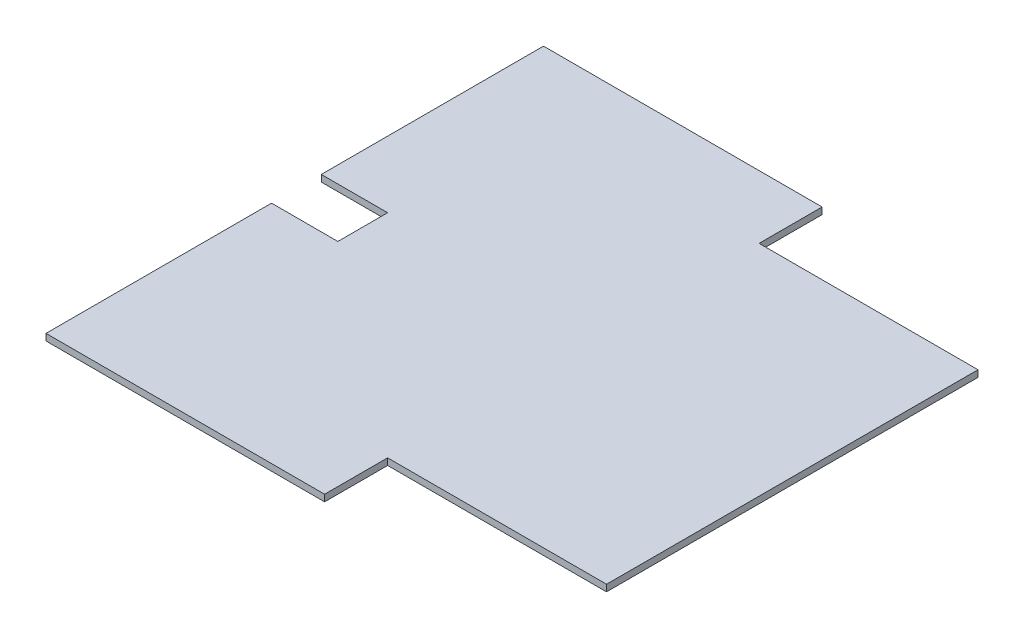
ISO-10303-21;
HEADER;
FILE_DESCRIPTION(('STEP AP214'),'2;1');
FILE_NAME('part.step','',(''),(''),'','','');
FILE_SCHEMA(('AUTOMOTIVE_DESIGN { 1 0 10303 214 1 1 1 1 }'));
ENDSEC;
DATA;
#1=APPLICATION_CONTEXT('core data for automotive mechanical design processes');
#2=APPLICATION_PROTOCOL_DEFINITION('international standard','automotive_design',2000,#1);
#3=PRODUCT_CONTEXT('',#1,'mechanical');
#4=PRODUCT('Part','Part','',(#3));
#5=PRODUCT_RELATED_PRODUCT_CATEGORY('part','',(#4));
#6=PRODUCT_DEFINITION_FORMATION('','',#4);
#7=PRODUCT_DEFINITION_CONTEXT('part definition',#1,'design');
#8=PRODUCT_DEFINITION('design','',#6,#7);
#9=PRODUCT_DEFINITION_SHAPE('','',#8);
#10=(LENGTH_UNIT() NAMED_UNIT(*) SI_UNIT(.MILLI.,.METRE.));
#11=(NAMED_UNIT(*) PLANE_ANGLE_UNIT() SI_UNIT($,.RADIAN.));
#12=(NAMED_UNIT(*) SI_UNIT($,.STERADIAN.) SOLID_ANGLE_UNIT());
#13=UNCERTAINTY_MEASURE_WITH_UNIT(LENGTH_MEASURE(1.E-05),#10,'distance_accuracy_value','');
#14=(GEOMETRIC_REPRESENTATION_CONTEXT(3) GLOBAL_UNCERTAINTY_ASSIGNED_CONTEXT((#13)) GLOBAL_UNIT_ASSIGNED_CONTEXT((#10,
#11,#12)) REPRESENTATION_CONTEXT('',''));
#15=CARTESIAN_POINT('',(0.,0.,0.));
#16=DIRECTION('',(0.,0.,1.));
#17=DIRECTION('',(1.,0.,0.));
#18=AXIS2_PLACEMENT_3D('',#15,#16,#17);
#19=CARTESIAN_POINT('',(-75.,2.,-75.));
#20=DIRECTION('',(1.,0.,0.));
#21=DIRECTION('',(0.,0.,-1.));
#22=AXIS2_PLACEMENT_3D('',#19,#20,#21);
#23=PLANE('',#22);
#24=DIRECTION('',(0.,0.,1.));
#25=VECTOR('',#24,1.);
#26=CARTESIAN_POINT('',(-75.,0.,-75.));
#27=LINE('',#26,#25);
#28=CARTESIAN_POINT('',(-75.,0.,-75.));
#29=VERTEX_POINT('',#28);
#30=CARTESIAN_POINT('',(-75.,0.,-7.99999999999999));
#31=VERTEX_POINT('',#30);
#32=EDGE_CURVE('E155',#29,#31,#27,.T.);
#33=ORIENTED_EDGE('',*,*,#32,.T.);
#34=DIRECTION('',(0.,1.,0.));
#35=VECTOR('',#34,1.);
#36=CARTESIAN_POINT('',(-75.,-0.00100000000000013,-7.99999999999999));
#37=LINE('',#36,#35);
#38=CARTESIAN_POINT('',(-75.,2.,-7.99999999999999));
#39=VERTEX_POINT('',#38);
#40=EDGE_CURVE('E218',#31,#39,#37,.T.);
#41=ORIENTED_EDGE('',*,*,#40,.T.);
#42=DIRECTION('',(0.,0.,1.));
#43=VECTOR('',#42,1.);
#44=CARTESIAN_POINT('',(-75.,2.,-75.));
#45=LINE('',#44,#43);
#46=CARTESIAN_POINT('',(-75.,2.,-75.));
#47=VERTEX_POINT('',#46);
#48=EDGE_CURVE('E161',#47,#39,#45,.T.);
#49=ORIENTED_EDGE('',*,*,#48,.F.);
#50=DIRECTION('',(0.,-1.,0.));
#51=VECTOR('',#50,1.);
#52=CARTESIAN_POINT('',(-75.,2.,-75.));
#53=LINE('',#52,#51);
#54=EDGE_CURVE('E11',#47,#29,#53,.T.);
#55=ORIENTED_EDGE('',*,*,#54,.T.);
#56=EDGE_LOOP('',(#33,#41,#49,#55));
#57=FACE_BOUND('',#56,.T.);
#58=ADVANCED_FACE('F35',(#57),#23,.F.);
#59=CARTESIAN_POINT('',(75.,2.,-75.));
#60=DIRECTION('',(-1.,0.,0.));
#61=DIRECTION('',(0.,0.,1.));
#62=AXIS2_PLACEMENT_3D('',#59,#60,#61);
#63=PLANE('',#62);
#64=DIRECTION('',(0.,0.,-1.));
#65=VECTOR('',#64,1.);
#66=CARTESIAN_POINT('',(75.,2.,-75.));
#67=LINE('',#66,#65);
#68=CARTESIAN_POINT('',(75.,2.,56.));
#69=VERTEX_POINT('',#68);
#70=CARTESIAN_POINT('',(75.,2.,-56.));
#71=VERTEX_POINT('',#70);
#72=EDGE_CURVE('E144',#69,#71,#67,.T.);
#73=ORIENTED_EDGE('',*,*,#72,.F.);
#74=DIRECTION('',(0.,-1.,0.));
#75=VECTOR('',#74,1.);
#76=CARTESIAN_POINT('',(75.,2.001,56.));
#77=LINE('',#76,#75);
#78=CARTESIAN_POINT('',(75.,0.,56.));
#79=VERTEX_POINT('',#78);
#80=EDGE_CURVE('E125',#69,#79,#77,.T.);
#81=ORIENTED_EDGE('',*,*,#80,.T.);
#82=DIRECTION('',(0.,0.,-1.));
#83=VECTOR('',#82,1.);
#84=CARTESIAN_POINT('',(75.,0.,-75.));
#85=LINE('',#84,#83);
#86=CARTESIAN_POINT('',(75.,0.,-56.));
#87=VERTEX_POINT('',#86);
#88=EDGE_CURVE('E166',#79,#87,#85,.T.);
#89=ORIENTED_EDGE('',*,*,#88,.T.);
#90=DIRECTION('',(0.,-1.,0.));
#91=VECTOR('',#90,1.);
#92=CARTESIAN_POINT('',(75.,2.001,-56.));
#93=LINE('',#92,#91);
#94=EDGE_CURVE('E58',#71,#87,#93,.T.);
#95=ORIENTED_EDGE('',*,*,#94,.F.);
#96=EDGE_LOOP('',(#73,#81,#89,#95));
#97=FACE_BOUND('',#96,.T.);
#98=ADVANCED_FACE('F37',(#97),#63,.F.);
#99=CARTESIAN_POINT('',(-75.,2.,-75.));
#100=DIRECTION('',(0.,0.,1.));
#101=DIRECTION('',(1.,0.,0.));
#102=AXIS2_PLACEMENT_3D('',#99,#100,#101);
#103=PLANE('',#102);
#104=DIRECTION('',(-1.,0.,0.));
#105=VECTOR('',#104,1.);
#106=CARTESIAN_POINT('',(-75.,2.,-75.));
#107=LINE('',#106,#105);
#108=CARTESIAN_POINT('',(8.99999999999998,2.,-75.));
#109=VERTEX_POINT('',#108);
#110=EDGE_CURVE('E149',#109,#47,#107,.T.);
#111=ORIENTED_EDGE('',*,*,#110,.F.);
#112=DIRECTION('',(0.,-1.,0.));
#113=VECTOR('',#112,1.);
#114=CARTESIAN_POINT('',(8.99999999999998,2.001,-75.));
#115=LINE('',#114,#113);
#116=CARTESIAN_POINT('',(8.99999999999998,0.,-75.));
#117=VERTEX_POINT('',#116);
#118=EDGE_CURVE('E197',#109,#117,#115,.T.);
#119=ORIENTED_EDGE('',*,*,#118,.T.);
#120=DIRECTION('',(-1.,0.,0.));
#121=VECTOR('',#120,1.);
#122=CARTESIAN_POINT('',(-75.,0.,-75.));
#123=LINE('',#122,#121);
#124=EDGE_CURVE('E168',#117,#29,#123,.T.);
#125=ORIENTED_EDGE('',*,*,#124,.T.);
#126=ORIENTED_EDGE('',*,*,#54,.F.);
#127=EDGE_LOOP('',(#111,#119,#125,#126));
#128=FACE_BOUND('',#127,.T.);
#129=ADVANCED_FACE('F233',(#128),#103,.F.);
#130=CARTESIAN_POINT('',(-75.,2.,7.00000000000001));
#131=VERTEX_POINT('',#130);
#132=CARTESIAN_POINT('',(-75.,2.,75.));
#133=VERTEX_POINT('',#132);
#134=EDGE_CURVE('E152',#131,#133,#45,.T.);
#135=ORIENTED_EDGE('',*,*,#134,.F.);
#136=DIRECTION('',(0.,1.,0.));
#137=VECTOR('',#136,1.);
#138=CARTESIAN_POINT('',(-75.,-0.00100000000000013,7.00000000000001));
#139=LINE('',#138,#137);
#140=CARTESIAN_POINT('',(-75.,0.,7.00000000000001));
#141=VERTEX_POINT('',#140);
#142=EDGE_CURVE('E217',#141,#131,#139,.T.);
#143=ORIENTED_EDGE('',*,*,#142,.F.);
#144=CARTESIAN_POINT('',(-75.,0.,75.));
#145=VERTEX_POINT('',#144);
#146=EDGE_CURVE('E170',#141,#145,#27,.T.);
#147=ORIENTED_EDGE('',*,*,#146,.T.);
#148=DIRECTION('',(0.,-1.,0.));
#149=VECTOR('',#148,1.);
#150=CARTESIAN_POINT('',(-75.,2.,75.));
#151=LINE('',#150,#149);
#152=EDGE_CURVE('E43',#133,#145,#151,.T.);
#153=ORIENTED_EDGE('',*,*,#152,.F.);
#154=EDGE_LOOP('',(#135,#143,#147,#153));
#155=FACE_BOUND('',#154,.T.);
#156=ADVANCED_FACE('F231',(#155),#23,.F.);
#157=CARTESIAN_POINT('',(-75.,2.,75.));
#158=DIRECTION('',(0.,0.,-1.));
#159=DIRECTION('',(-1.,0.,0.));
#160=AXIS2_PLACEMENT_3D('',#157,#158,#159);
#161=PLANE('',#160);
#162=DIRECTION('',(1.,0.,0.));
#163=VECTOR('',#162,1.);
#164=CARTESIAN_POINT('',(-75.,0.,75.));
#165=LINE('',#164,#163);
#166=CARTESIAN_POINT('',(9.00000000000004,0.,75.));
#167=VERTEX_POINT('',#166);
#168=EDGE_CURVE('E150',#145,#167,#165,.T.);
#169=ORIENTED_EDGE('',*,*,#168,.T.);
#170=DIRECTION('',(0.,-1.,0.));
#171=VECTOR('',#170,1.);
#172=CARTESIAN_POINT('',(9.00000000000003,2.001,75.));
#173=LINE('',#172,#171);
#174=CARTESIAN_POINT('',(9.00000000000003,2.,75.));
#175=VERTEX_POINT('',#174);
#176=EDGE_CURVE('E50',#175,#167,#173,.T.);
#177=ORIENTED_EDGE('',*,*,#176,.F.);
#178=DIRECTION('',(1.,0.,0.));
#179=VECTOR('',#178,1.);
#180=CARTESIAN_POINT('',(-75.,2.,75.));
#181=LINE('',#180,#179);
#182=EDGE_CURVE('E164',#133,#175,#181,.T.);
#183=ORIENTED_EDGE('',*,*,#182,.F.);
#184=ORIENTED_EDGE('',*,*,#152,.T.);
#185=EDGE_LOOP('',(#169,#177,#183,#184));
#186=FACE_BOUND('',#185,.T.);
#187=ADVANCED_FACE('F177',(#186),#161,.F.);
#188=CARTESIAN_POINT('',(0.,2.,0.));
#189=DIRECTION('',(0.,1.,0.));
#190=DIRECTION('',(0.,0.,1.));
#191=AXIS2_PLACEMENT_3D('',#188,#189,#190);
#192=PLANE('',#191);
#193=DIRECTION('',(1.,0.,0.));
#194=VECTOR('',#193,1.);
#195=CARTESIAN_POINT('',(75.,2.,56.));
#196=LINE('',#195,#194);
#197=CARTESIAN_POINT('',(9.00000000000004,2.,56.));
#198=VERTEX_POINT('',#197);
#199=EDGE_CURVE('E128',#198,#69,#196,.T.);
#200=ORIENTED_EDGE('',*,*,#199,.T.);
#201=ORIENTED_EDGE('',*,*,#72,.T.);
#202=DIRECTION('',(-1.,0.,0.));
#203=VECTOR('',#202,1.);
#204=CARTESIAN_POINT('',(75.,2.,-56.));
#205=LINE('',#204,#203);
#206=CARTESIAN_POINT('',(8.99999999999998,2.,-56.));
#207=VERTEX_POINT('',#206);
#208=EDGE_CURVE('E200',#71,#207,#205,.T.);
#209=ORIENTED_EDGE('',*,*,#208,.T.);
#210=DIRECTION('',(0.,0.,-1.));
#211=VECTOR('',#210,1.);
#212=CARTESIAN_POINT('',(8.99999999999998,2.,-75.));
#213=LINE('',#212,#211);
#214=EDGE_CURVE('E190',#207,#109,#213,.T.);
#215=ORIENTED_EDGE('',*,*,#214,.T.);
#216=ORIENTED_EDGE('',*,*,#110,.T.);
#217=ORIENTED_EDGE('',*,*,#48,.T.);
#218=DIRECTION('',(-1.,0.,0.));
#219=VECTOR('',#218,1.);
#220=CARTESIAN_POINT('',(-75.,2.,-7.99999999999999));
#221=LINE('',#220,#219);
#222=CARTESIAN_POINT('',(-55.,2.,-8.));
#223=VERTEX_POINT('',#222);
#224=EDGE_CURVE('E215',#223,#39,#221,.T.);
#225=ORIENTED_EDGE('',*,*,#224,.F.);
#226=DIRECTION('',(0.,0.,-1.));
#227=VECTOR('',#226,1.);
#228=CARTESIAN_POINT('',(-55.,2.,-8.));
#229=LINE('',#228,#227);
#230=CARTESIAN_POINT('',(-55.,2.,7.));
#231=VERTEX_POINT('',#230);
#232=EDGE_CURVE('E212',#231,#223,#229,.T.);
#233=ORIENTED_EDGE('',*,*,#232,.F.);
#234=DIRECTION('',(1.,0.,0.));
#235=VECTOR('',#234,1.);
#236=CARTESIAN_POINT('',(-75.,2.,7.00000000000001));
#237=LINE('',#236,#235);
#238=EDGE_CURVE('E209',#131,#231,#237,.T.);
#239=ORIENTED_EDGE('',*,*,#238,.F.);
#240=ORIENTED_EDGE('',*,*,#134,.T.);
#241=ORIENTED_EDGE('',*,*,#182,.T.);
#242=DIRECTION('',(0.,0.,-1.));
#243=VECTOR('',#242,1.);
#244=CARTESIAN_POINT('',(9.00000000000003,2.,75.));
#245=LINE('',#244,#243);
#246=EDGE_CURVE('E146',#175,#198,#245,.T.);
#247=ORIENTED_EDGE('',*,*,#246,.T.);
#248=EDGE_LOOP('',(#200,#201,#209,#215,#216,#217,#225,#233,#239,#240,#241,#247));
#249=FACE_BOUND('',#248,.T.);
#250=ADVANCED_FACE('F142',(#249),#192,.T.);
#251=CARTESIAN_POINT('',(0.,0.,0.));
#252=DIRECTION('',(0.,1.,0.));
#253=DIRECTION('',(0.,0.,1.));
#254=AXIS2_PLACEMENT_3D('',#251,#252,#253);
#255=PLANE('',#254);
#256=ORIENTED_EDGE('',*,*,#88,.F.);
#257=DIRECTION('',(1.,0.,0.));
#258=VECTOR('',#257,1.);
#259=CARTESIAN_POINT('',(75.,0.,56.));
#260=LINE('',#259,#258);
#261=CARTESIAN_POINT('',(9.00000000000004,0.,56.));
#262=VERTEX_POINT('',#261);
#263=EDGE_CURVE('E131',#262,#79,#260,.T.);
#264=ORIENTED_EDGE('',*,*,#263,.F.);
#265=DIRECTION('',(0.,0.,-1.));
#266=VECTOR('',#265,1.);
#267=CARTESIAN_POINT('',(9.00000000000003,0.,75.));
#268=LINE('',#267,#266);
#269=EDGE_CURVE('E147',#167,#262,#268,.T.);
#270=ORIENTED_EDGE('',*,*,#269,.F.);
#271=ORIENTED_EDGE('',*,*,#168,.F.);
#272=ORIENTED_EDGE('',*,*,#146,.F.);
#273=DIRECTION('',(-1.,0.,0.));
#274=VECTOR('',#273,1.);
#275=CARTESIAN_POINT('',(-75.,0.,7.00000000000001));
#276=LINE('',#275,#274);
#277=CARTESIAN_POINT('',(-55.,0.,7.));
#278=VERTEX_POINT('',#277);
#279=EDGE_CURVE('E158',#278,#141,#276,.T.);
#280=ORIENTED_EDGE('',*,*,#279,.F.);
#281=DIRECTION('',(0.,0.,1.));
#282=VECTOR('',#281,1.);
#283=CARTESIAN_POINT('',(-55.,0.,-8.));
#284=LINE('',#283,#282);
#285=CARTESIAN_POINT('',(-55.,0.,-8.));
#286=VERTEX_POINT('',#285);
#287=EDGE_CURVE('E136',#286,#278,#284,.T.);
#288=ORIENTED_EDGE('',*,*,#287,.F.);
#289=DIRECTION('',(1.,0.,0.));
#290=VECTOR('',#289,1.);
#291=CARTESIAN_POINT('',(-75.,0.,-7.99999999999999));
#292=LINE('',#291,#290);
#293=EDGE_CURVE('E206',#31,#286,#292,.T.);
#294=ORIENTED_EDGE('',*,*,#293,.F.);
#295=ORIENTED_EDGE('',*,*,#32,.F.);
#296=ORIENTED_EDGE('',*,*,#124,.F.);
#297=DIRECTION('',(0.,0.,-1.));
#298=VECTOR('',#297,1.);
#299=CARTESIAN_POINT('',(8.99999999999998,0.,-75.));
#300=LINE('',#299,#298);
#301=CARTESIAN_POINT('',(8.99999999999998,0.,-56.));
#302=VERTEX_POINT('',#301);
#303=EDGE_CURVE('E195',#302,#117,#300,.T.);
#304=ORIENTED_EDGE('',*,*,#303,.F.);
#305=DIRECTION('',(-1.,0.,0.));
#306=VECTOR('',#305,1.);
#307=CARTESIAN_POINT('',(75.,0.,-56.));
#308=LINE('',#307,#306);
#309=EDGE_CURVE('E193',#87,#302,#308,.T.);
#310=ORIENTED_EDGE('',*,*,#309,.F.);
#311=EDGE_LOOP('',(#256,#264,#270,#271,#272,#280,#288,#294,#295,#296,#304,#310));
#312=FACE_BOUND('',#311,.T.);
#313=ADVANCED_FACE('F182',(#312),#255,.F.);
#314=CARTESIAN_POINT('',(-75.,-0.00100000000000013,-7.99999999999999));
#315=DIRECTION('',(0.,0.,-1.));
#316=DIRECTION('',(-1.,0.,0.));
#317=AXIS2_PLACEMENT_3D('',#314,#315,#316);
#318=PLANE('',#317);
#319=ORIENTED_EDGE('',*,*,#293,.T.);
#320=DIRECTION('',(0.,1.,0.));
#321=VECTOR('',#320,1.);
#322=CARTESIAN_POINT('',(-55.,-0.00100000000000013,-8.));
#323=LINE('',#322,#321);
#324=EDGE_CURVE('E221',#286,#223,#323,.T.);
#325=ORIENTED_EDGE('',*,*,#324,.T.);
#326=ORIENTED_EDGE('',*,*,#224,.T.);
#327=ORIENTED_EDGE('',*,*,#40,.F.);
#328=EDGE_LOOP('',(#319,#325,#326,#327));
#329=FACE_BOUND('',#328,.T.);
#330=ADVANCED_FACE('F254',(#329),#318,.F.);
#331=CARTESIAN_POINT('',(-55.,-0.00100000000000013,-8.));
#332=DIRECTION('',(1.,0.,0.));
#333=DIRECTION('',(0.,0.,-1.));
#334=AXIS2_PLACEMENT_3D('',#331,#332,#333);
#335=PLANE('',#334);
#336=ORIENTED_EDGE('',*,*,#287,.T.);
#337=DIRECTION('',(0.,1.,0.));
#338=VECTOR('',#337,1.);
#339=CARTESIAN_POINT('',(-55.,-0.00100000000000013,7.));
#340=LINE('',#339,#338);
#341=EDGE_CURVE('E223',#278,#231,#340,.T.);
#342=ORIENTED_EDGE('',*,*,#341,.T.);
#343=ORIENTED_EDGE('',*,*,#232,.T.);
#344=ORIENTED_EDGE('',*,*,#324,.F.);
#345=EDGE_LOOP('',(#336,#342,#343,#344));
#346=FACE_BOUND('',#345,.T.);
#347=ADVANCED_FACE('F273',(#346),#335,.F.);
#348=CARTESIAN_POINT('',(-75.,-0.00100000000000013,7.00000000000001));
#349=DIRECTION('',(0.,0.,1.));
#350=DIRECTION('',(1.,0.,0.));
#351=AXIS2_PLACEMENT_3D('',#348,#349,#350);
#352=PLANE('',#351);
#353=ORIENTED_EDGE('',*,*,#279,.T.);
#354=ORIENTED_EDGE('',*,*,#142,.T.);
#355=ORIENTED_EDGE('',*,*,#238,.T.);
#356=ORIENTED_EDGE('',*,*,#341,.F.);
#357=EDGE_LOOP('',(#353,#354,#355,#356));
#358=FACE_BOUND('',#357,.T.);
#359=ADVANCED_FACE('F227',(#358),#352,.F.);
#360=CARTESIAN_POINT('',(8.99999999999998,2.001,-75.));
#361=DIRECTION('',(-1.,0.,0.));
#362=DIRECTION('',(0.,0.,1.));
#363=AXIS2_PLACEMENT_3D('',#360,#361,#362);
#364=PLANE('',#363);
#365=DIRECTION('',(0.,-1.,0.));
#366=VECTOR('',#365,1.);
#367=CARTESIAN_POINT('',(8.99999999999998,2.001,-56.));
#368=LINE('',#367,#366);
#369=EDGE_CURVE('E201',#207,#302,#368,.T.);
#370=ORIENTED_EDGE('',*,*,#369,.T.);
#371=ORIENTED_EDGE('',*,*,#303,.T.);
#372=ORIENTED_EDGE('',*,*,#118,.F.);
#373=ORIENTED_EDGE('',*,*,#214,.F.);
#374=EDGE_LOOP('',(#370,#371,#372,#373));
#375=FACE_BOUND('',#374,.T.);
#376=ADVANCED_FACE('F257',(#375),#364,.F.);
#377=CARTESIAN_POINT('',(75.,2.001,-56.));
#378=DIRECTION('',(0.,0.,1.));
#379=DIRECTION('',(1.,0.,0.));
#380=AXIS2_PLACEMENT_3D('',#377,#378,#379);
#381=PLANE('',#380);
#382=ORIENTED_EDGE('',*,*,#94,.T.);
#383=ORIENTED_EDGE('',*,*,#309,.T.);
#384=ORIENTED_EDGE('',*,*,#369,.F.);
#385=ORIENTED_EDGE('',*,*,#208,.F.);
#386=EDGE_LOOP('',(#382,#383,#384,#385));
#387=FACE_BOUND('',#386,.T.);
#388=ADVANCED_FACE('F259',(#387),#381,.F.);
#389=CARTESIAN_POINT('',(75.,2.001,56.));
#390=DIRECTION('',(0.,0.,-1.));
#391=DIRECTION('',(-1.,0.,0.));
#392=AXIS2_PLACEMENT_3D('',#389,#390,#391);
#393=PLANE('',#392);
#394=DIRECTION('',(0.,-1.,0.));
#395=VECTOR('',#394,1.);
#396=CARTESIAN_POINT('',(9.00000000000004,2.001,56.));
#397=LINE('',#396,#395);
#398=EDGE_CURVE('E137',#198,#262,#397,.T.);
#399=ORIENTED_EDGE('',*,*,#398,.T.);
#400=ORIENTED_EDGE('',*,*,#263,.T.);
#401=ORIENTED_EDGE('',*,*,#80,.F.);
#402=ORIENTED_EDGE('',*,*,#199,.F.);
#403=EDGE_LOOP('',(#399,#400,#401,#402));
#404=FACE_BOUND('',#403,.T.);
#405=ADVANCED_FACE('F127',(#404),#393,.F.);
#406=CARTESIAN_POINT('',(9.00000000000003,2.001,75.));
#407=DIRECTION('',(-1.,0.,0.));
#408=DIRECTION('',(0.,0.,1.));
#409=AXIS2_PLACEMENT_3D('',#406,#407,#408);
#410=PLANE('',#409);
#411=ORIENTED_EDGE('',*,*,#176,.T.);
#412=ORIENTED_EDGE('',*,*,#269,.T.);
#413=ORIENTED_EDGE('',*,*,#398,.F.);
#414=ORIENTED_EDGE('',*,*,#246,.F.);
#415=EDGE_LOOP('',(#411,#412,#413,#414));
#416=FACE_BOUND('',#415,.T.);
#417=ADVANCED_FACE('F266',(#416),#410,.F.);
#418=CLOSED_SHELL('',(#58,#98,#129,#156,#187,#250,#313,#330,#347,#359,#376,#388,#405,#417));
#419=MANIFOLD_SOLID_BREP('B2',#418);
#420=ADVANCED_BREP_SHAPE_REPRESENTATION('',(#18,#419),#14);
#421=SHAPE_DEFINITION_REPRESENTATION(#9,#420);
ENDSEC;
END-ISO-10303-21;
